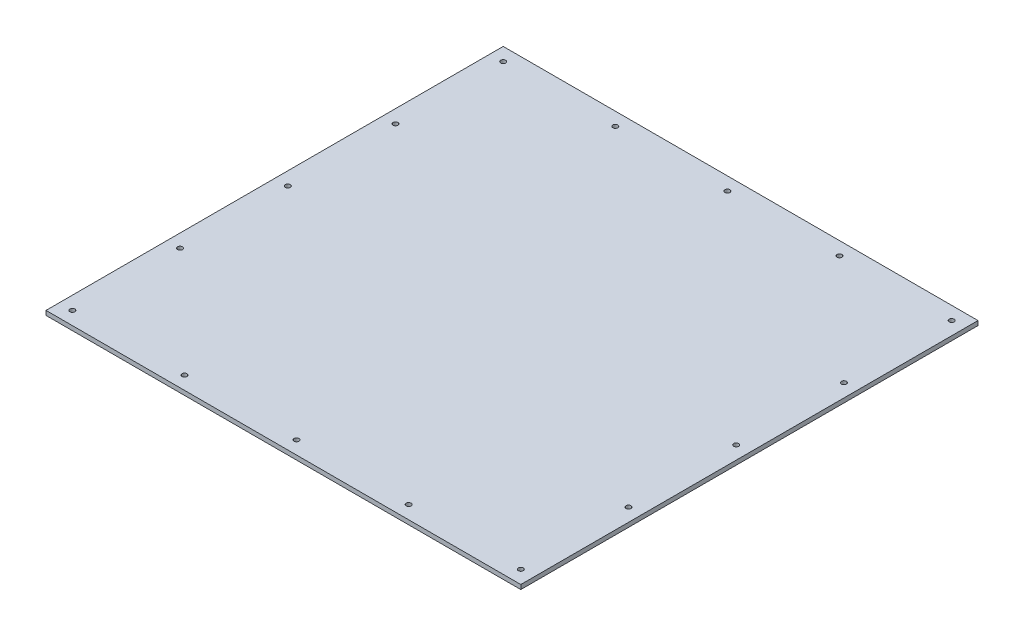
ISO-10303-21;
HEADER;
FILE_DESCRIPTION(('STEP AP214'),'2;1');
FILE_NAME('part.step','',(''),(''),'','','');
FILE_SCHEMA(('AUTOMOTIVE_DESIGN { 1 0 10303 214 1 1 1 1 }'));
ENDSEC;
DATA;
#1=APPLICATION_CONTEXT('core data for automotive mechanical design processes');
#2=APPLICATION_PROTOCOL_DEFINITION('international standard','automotive_design',2000,#1);
#3=PRODUCT_CONTEXT('',#1,'mechanical');
#4=PRODUCT('Part','Part','',(#3));
#5=PRODUCT_RELATED_PRODUCT_CATEGORY('part','',(#4));
#6=PRODUCT_DEFINITION_FORMATION('','',#4);
#7=PRODUCT_DEFINITION_CONTEXT('part definition',#1,'design');
#8=PRODUCT_DEFINITION('design','',#6,#7);
#9=PRODUCT_DEFINITION_SHAPE('','',#8);
#10=(LENGTH_UNIT() NAMED_UNIT(*) SI_UNIT(.MILLI.,.METRE.));
#11=(NAMED_UNIT(*) PLANE_ANGLE_UNIT() SI_UNIT($,.RADIAN.));
#12=(NAMED_UNIT(*) SI_UNIT($,.STERADIAN.) SOLID_ANGLE_UNIT());
#13=UNCERTAINTY_MEASURE_WITH_UNIT(LENGTH_MEASURE(1.E-05),#10,'distance_accuracy_value','');
#14=(GEOMETRIC_REPRESENTATION_CONTEXT(3) GLOBAL_UNCERTAINTY_ASSIGNED_CONTEXT((#13)) GLOBAL_UNIT_ASSIGNED_CONTEXT((#10,
#11,#12)) REPRESENTATION_CONTEXT('',''));
#15=CARTESIAN_POINT('',(0.,0.,0.));
#16=DIRECTION('',(0.,0.,1.));
#17=DIRECTION('',(1.,0.,0.));
#18=AXIS2_PLACEMENT_3D('',#15,#16,#17);
#19=CARTESIAN_POINT('',(0.,6.35,0.));
#20=DIRECTION('',(0.,1.,0.));
#21=DIRECTION('',(0.,0.,1.));
#22=AXIS2_PLACEMENT_3D('',#19,#20,#21);
#23=PLANE('',#22);
#24=CARTESIAN_POINT('',(504.825,6.35,641.35));
#25=DIRECTION('',(0.,1.,0.));
#26=DIRECTION('',(0.,0.,1.));
#27=AXIS2_PLACEMENT_3D('',#24,#25,#26);
#28=CIRCLE('',#27,3.56999999999996);
#29=CARTESIAN_POINT('',(504.825,6.35,644.92));
#30=VERTEX_POINT('',#29);
#31=EDGE_CURVE('E156',#30,#30,#28,.T.);
#32=ORIENTED_EDGE('',*,*,#31,.F.);
#33=EDGE_LOOP('',(#32));
#34=FACE_BOUND('',#33,.T.);
#35=CARTESIAN_POINT('',(19.0500000000001,6.35,485.775));
#36=DIRECTION('',(0.,1.,0.));
#37=DIRECTION('',(0.,0.,1.));
#38=AXIS2_PLACEMENT_3D('',#35,#36,#37);
#39=CIRCLE('',#38,3.57);
#40=CARTESIAN_POINT('',(19.0500000000001,6.35,489.345));
#41=VERTEX_POINT('',#40);
#42=EDGE_CURVE('E173',#41,#41,#39,.T.);
#43=ORIENTED_EDGE('',*,*,#42,.F.);
#44=EDGE_LOOP('',(#43));
#45=FACE_BOUND('',#44,.T.);
#46=CARTESIAN_POINT('',(666.75,6.35,174.625));
#47=DIRECTION('',(0.,1.,0.));
#48=DIRECTION('',(0.,0.,1.));
#49=AXIS2_PLACEMENT_3D('',#46,#47,#48);
#50=CIRCLE('',#49,3.56999999999996);
#51=CARTESIAN_POINT('',(666.75,6.35,178.195));
#52=VERTEX_POINT('',#51);
#53=EDGE_CURVE('E189',#52,#52,#50,.T.);
#54=ORIENTED_EDGE('',*,*,#53,.F.);
#55=EDGE_LOOP('',(#54));
#56=FACE_BOUND('',#55,.T.);
#57=CARTESIAN_POINT('',(180.975,6.35,19.05));
#58=DIRECTION('',(0.,1.,0.));
#59=DIRECTION('',(0.,0.,1.));
#60=AXIS2_PLACEMENT_3D('',#57,#58,#59);
#61=CIRCLE('',#60,3.56999999999998);
#62=CARTESIAN_POINT('',(180.975,6.35,22.62));
#63=VERTEX_POINT('',#62);
#64=EDGE_CURVE('E205',#63,#63,#61,.T.);
#65=ORIENTED_EDGE('',*,*,#64,.F.);
#66=EDGE_LOOP('',(#65));
#67=FACE_BOUND('',#66,.T.);
#68=CARTESIAN_POINT('',(342.9,6.35,641.35));
#69=DIRECTION('',(0.,1.,0.));
#70=DIRECTION('',(0.,0.,1.));
#71=AXIS2_PLACEMENT_3D('',#68,#69,#70);
#72=CIRCLE('',#71,3.57000000000001);
#73=CARTESIAN_POINT('',(342.9,6.35,644.92));
#74=VERTEX_POINT('',#73);
#75=EDGE_CURVE('E221',#74,#74,#72,.T.);
#76=ORIENTED_EDGE('',*,*,#75,.F.);
#77=EDGE_LOOP('',(#76));
#78=FACE_BOUND('',#77,.T.);
#79=CARTESIAN_POINT('',(342.9,6.35,19.05));
#80=DIRECTION('',(0.,1.,0.));
#81=DIRECTION('',(0.,0.,1.));
#82=AXIS2_PLACEMENT_3D('',#79,#80,#81);
#83=CIRCLE('',#82,3.57000000000001);
#84=CARTESIAN_POINT('',(342.9,6.35,22.62));
#85=VERTEX_POINT('',#84);
#86=EDGE_CURVE('E237',#85,#85,#83,.T.);
#87=ORIENTED_EDGE('',*,*,#86,.F.);
#88=EDGE_LOOP('',(#87));
#89=FACE_BOUND('',#88,.T.);
#90=CARTESIAN_POINT('',(666.75,6.35,641.35));
#91=DIRECTION('',(0.,1.,0.));
#92=DIRECTION('',(0.,0.,1.));
#93=AXIS2_PLACEMENT_3D('',#90,#91,#92);
#94=CIRCLE('',#93,3.56999999999996);
#95=CARTESIAN_POINT('',(666.75,6.35,644.92));
#96=VERTEX_POINT('',#95);
#97=EDGE_CURVE('E254',#96,#96,#94,.T.);
#98=ORIENTED_EDGE('',*,*,#97,.F.);
#99=EDGE_LOOP('',(#98));
#100=FACE_BOUND('',#99,.T.);
#101=CARTESIAN_POINT('',(19.05,6.35,19.05));
#102=DIRECTION('',(0.,1.,0.));
#103=DIRECTION('',(0.,0.,1.));
#104=AXIS2_PLACEMENT_3D('',#101,#102,#103);
#105=CIRCLE('',#104,3.57);
#106=CARTESIAN_POINT('',(19.05,6.35,22.62));
#107=VERTEX_POINT('',#106);
#108=EDGE_CURVE('E134',#107,#107,#105,.T.);
#109=ORIENTED_EDGE('',*,*,#108,.F.);
#110=EDGE_LOOP('',(#109));
#111=FACE_BOUND('',#110,.T.);
#112=DIRECTION('',(0.,0.,1.));
#113=VECTOR('',#112,1.);
#114=CARTESIAN_POINT('',(0.,6.35,0.));
#115=LINE('',#114,#113);
#116=CARTESIAN_POINT('',(0.,6.35,0.));
#117=VERTEX_POINT('',#116);
#118=CARTESIAN_POINT('',(0.,6.35,660.4));
#119=VERTEX_POINT('',#118);
#120=EDGE_CURVE('E101',#117,#119,#115,.T.);
#121=ORIENTED_EDGE('',*,*,#120,.T.);
#122=DIRECTION('',(1.,0.,0.));
#123=VECTOR('',#122,1.);
#124=CARTESIAN_POINT('',(0.,6.35,660.4));
#125=LINE('',#124,#123);
#126=CARTESIAN_POINT('',(685.8,6.35,660.4));
#127=VERTEX_POINT('',#126);
#128=EDGE_CURVE('E96',#119,#127,#125,.T.);
#129=ORIENTED_EDGE('',*,*,#128,.T.);
#130=DIRECTION('',(0.,0.,-1.));
#131=VECTOR('',#130,1.);
#132=CARTESIAN_POINT('',(685.8,6.35,0.));
#133=LINE('',#132,#131);
#134=CARTESIAN_POINT('',(685.8,6.35,0.));
#135=VERTEX_POINT('',#134);
#136=EDGE_CURVE('E99',#127,#135,#133,.T.);
#137=ORIENTED_EDGE('',*,*,#136,.T.);
#138=DIRECTION('',(-1.,0.,0.));
#139=VECTOR('',#138,1.);
#140=CARTESIAN_POINT('',(0.,6.35,0.));
#141=LINE('',#140,#139);
#142=EDGE_CURVE('E66',#135,#117,#141,.T.);
#143=ORIENTED_EDGE('',*,*,#142,.T.);
#144=EDGE_LOOP('',(#121,#129,#137,#143));
#145=FACE_BOUND('',#144,.T.);
#146=CARTESIAN_POINT('',(666.75,6.35,19.0499999999999));
#147=DIRECTION('',(0.,1.,0.));
#148=DIRECTION('',(0.,0.,1.));
#149=AXIS2_PLACEMENT_3D('',#146,#147,#148);
#150=CIRCLE('',#149,3.56999999999995);
#151=CARTESIAN_POINT('',(666.75,6.35,22.6199999999999));
#152=VERTEX_POINT('',#151);
#153=EDGE_CURVE('E135',#152,#152,#150,.T.);
#154=ORIENTED_EDGE('',*,*,#153,.F.);
#155=EDGE_LOOP('',(#154));
#156=FACE_BOUND('',#155,.T.);
#157=CARTESIAN_POINT('',(19.0499999999999,6.35,641.35));
#158=DIRECTION('',(0.,1.,0.));
#159=DIRECTION('',(0.,0.,1.));
#160=AXIS2_PLACEMENT_3D('',#157,#158,#159);
#161=CIRCLE('',#160,3.57);
#162=CARTESIAN_POINT('',(19.0499999999999,6.35,644.92));
#163=VERTEX_POINT('',#162);
#164=EDGE_CURVE('E245',#163,#163,#161,.T.);
#165=ORIENTED_EDGE('',*,*,#164,.F.);
#166=EDGE_LOOP('',(#165));
#167=FACE_BOUND('',#166,.T.);
#168=CARTESIAN_POINT('',(19.0499999999999,6.35,330.2));
#169=DIRECTION('',(0.,1.,0.));
#170=DIRECTION('',(0.,0.,1.));
#171=AXIS2_PLACEMENT_3D('',#168,#169,#170);
#172=CIRCLE('',#171,3.57);
#173=CARTESIAN_POINT('',(19.0499999999999,6.35,333.77));
#174=VERTEX_POINT('',#173);
#175=EDGE_CURVE('E229',#174,#174,#172,.T.);
#176=ORIENTED_EDGE('',*,*,#175,.F.);
#177=EDGE_LOOP('',(#176));
#178=FACE_BOUND('',#177,.T.);
#179=CARTESIAN_POINT('',(666.75,6.35,330.2));
#180=DIRECTION('',(0.,1.,0.));
#181=DIRECTION('',(0.,0.,1.));
#182=AXIS2_PLACEMENT_3D('',#179,#180,#181);
#183=CIRCLE('',#182,3.56999999999996);
#184=CARTESIAN_POINT('',(666.75,6.35,333.77));
#185=VERTEX_POINT('',#184);
#186=EDGE_CURVE('E213',#185,#185,#183,.T.);
#187=ORIENTED_EDGE('',*,*,#186,.F.);
#188=EDGE_LOOP('',(#187));
#189=FACE_BOUND('',#188,.T.);
#190=CARTESIAN_POINT('',(504.825,6.35,19.0499999999999));
#191=DIRECTION('',(0.,1.,0.));
#192=DIRECTION('',(0.,0.,1.));
#193=AXIS2_PLACEMENT_3D('',#190,#191,#192);
#194=CIRCLE('',#193,3.56999999999995);
#195=CARTESIAN_POINT('',(504.825,6.35,22.6199999999999));
#196=VERTEX_POINT('',#195);
#197=EDGE_CURVE('E197',#196,#196,#194,.T.);
#198=ORIENTED_EDGE('',*,*,#197,.F.);
#199=EDGE_LOOP('',(#198));
#200=FACE_BOUND('',#199,.T.);
#201=CARTESIAN_POINT('',(19.05,6.35,174.625));
#202=DIRECTION('',(0.,1.,0.));
#203=DIRECTION('',(0.,0.,1.));
#204=AXIS2_PLACEMENT_3D('',#201,#202,#203);
#205=CIRCLE('',#204,3.57);
#206=CARTESIAN_POINT('',(19.05,6.35,178.195));
#207=VERTEX_POINT('',#206);
#208=EDGE_CURVE('E181',#207,#207,#205,.T.);
#209=ORIENTED_EDGE('',*,*,#208,.F.);
#210=EDGE_LOOP('',(#209));
#211=FACE_BOUND('',#210,.T.);
#212=CARTESIAN_POINT('',(666.75,6.35,485.775));
#213=DIRECTION('',(0.,1.,0.));
#214=DIRECTION('',(0.,0.,1.));
#215=AXIS2_PLACEMENT_3D('',#212,#213,#214);
#216=CIRCLE('',#215,3.56999999999996);
#217=CARTESIAN_POINT('',(666.75,6.35,489.345));
#218=VERTEX_POINT('',#217);
#219=EDGE_CURVE('E165',#218,#218,#216,.T.);
#220=ORIENTED_EDGE('',*,*,#219,.F.);
#221=EDGE_LOOP('',(#220));
#222=FACE_BOUND('',#221,.T.);
#223=CARTESIAN_POINT('',(180.975,6.35,641.35));
#224=DIRECTION('',(0.,1.,0.));
#225=DIRECTION('',(0.,0.,1.));
#226=AXIS2_PLACEMENT_3D('',#223,#224,#225);
#227=CIRCLE('',#226,3.56999999999998);
#228=CARTESIAN_POINT('',(180.975,6.35,644.92));
#229=VERTEX_POINT('',#228);
#230=EDGE_CURVE('E155',#229,#229,#227,.T.);
#231=ORIENTED_EDGE('',*,*,#230,.F.);
#232=EDGE_LOOP('',(#231));
#233=FACE_BOUND('',#232,.T.);
#234=ADVANCED_FACE('F48',(#34,#45,#56,#67,#78,#89,#100,#111,#145,#156,#167,#178,#189,#200,#211,
#222,#233),#23,.T.);
#235=CARTESIAN_POINT('',(0.,0.,0.));
#236=DIRECTION('',(0.,1.,0.));
#237=DIRECTION('',(0.,0.,1.));
#238=AXIS2_PLACEMENT_3D('',#235,#236,#237);
#239=PLANE('',#238);
#240=DIRECTION('',(0.,0.,1.));
#241=VECTOR('',#240,1.);
#242=CARTESIAN_POINT('',(0.,0.,0.));
#243=LINE('',#242,#241);
#244=CARTESIAN_POINT('',(0.,0.,0.));
#245=VERTEX_POINT('',#244);
#246=CARTESIAN_POINT('',(0.,0.,660.4));
#247=VERTEX_POINT('',#246);
#248=EDGE_CURVE('E119',#245,#247,#243,.T.);
#249=ORIENTED_EDGE('',*,*,#248,.F.);
#250=DIRECTION('',(-1.,0.,0.));
#251=VECTOR('',#250,1.);
#252=CARTESIAN_POINT('',(0.,0.,0.));
#253=LINE('',#252,#251);
#254=CARTESIAN_POINT('',(685.8,0.,0.));
#255=VERTEX_POINT('',#254);
#256=EDGE_CURVE('E89',#255,#245,#253,.T.);
#257=ORIENTED_EDGE('',*,*,#256,.F.);
#258=DIRECTION('',(0.,0.,-1.));
#259=VECTOR('',#258,1.);
#260=CARTESIAN_POINT('',(685.8,0.,0.));
#261=LINE('',#260,#259);
#262=CARTESIAN_POINT('',(685.8,0.,660.4));
#263=VERTEX_POINT('',#262);
#264=EDGE_CURVE('E83',#263,#255,#261,.T.);
#265=ORIENTED_EDGE('',*,*,#264,.F.);
#266=DIRECTION('',(1.,0.,0.));
#267=VECTOR('',#266,1.);
#268=CARTESIAN_POINT('',(0.,0.,660.4));
#269=LINE('',#268,#267);
#270=EDGE_CURVE('E106',#247,#263,#269,.T.);
#271=ORIENTED_EDGE('',*,*,#270,.F.);
#272=EDGE_LOOP('',(#249,#257,#265,#271));
#273=FACE_BOUND('',#272,.T.);
#274=CARTESIAN_POINT('',(19.05,0.,19.05));
#275=DIRECTION('',(0.,1.,0.));
#276=DIRECTION('',(0.,0.,1.));
#277=AXIS2_PLACEMENT_3D('',#274,#275,#276);
#278=CIRCLE('',#277,3.57);
#279=CARTESIAN_POINT('',(19.05,0.,22.62));
#280=VERTEX_POINT('',#279);
#281=EDGE_CURVE('E130',#280,#280,#278,.T.);
#282=ORIENTED_EDGE('',*,*,#281,.T.);
#283=EDGE_LOOP('',(#282));
#284=FACE_BOUND('',#283,.T.);
#285=CARTESIAN_POINT('',(666.75,0.,19.0499999999999));
#286=DIRECTION('',(0.,1.,0.));
#287=DIRECTION('',(0.,0.,1.));
#288=AXIS2_PLACEMENT_3D('',#285,#286,#287);
#289=CIRCLE('',#288,3.56999999999995);
#290=CARTESIAN_POINT('',(666.75,0.,22.6199999999999));
#291=VERTEX_POINT('',#290);
#292=EDGE_CURVE('E140',#291,#291,#289,.T.);
#293=ORIENTED_EDGE('',*,*,#292,.T.);
#294=EDGE_LOOP('',(#293));
#295=FACE_BOUND('',#294,.T.);
#296=CARTESIAN_POINT('',(666.75,0.,641.35));
#297=DIRECTION('',(0.,1.,0.));
#298=DIRECTION('',(0.,0.,1.));
#299=AXIS2_PLACEMENT_3D('',#296,#297,#298);
#300=CIRCLE('',#299,3.56999999999996);
#301=CARTESIAN_POINT('',(666.75,0.,644.92));
#302=VERTEX_POINT('',#301);
#303=EDGE_CURVE('E250',#302,#302,#300,.T.);
#304=ORIENTED_EDGE('',*,*,#303,.T.);
#305=EDGE_LOOP('',(#304));
#306=FACE_BOUND('',#305,.T.);
#307=CARTESIAN_POINT('',(19.0499999999999,0.,641.35));
#308=DIRECTION('',(0.,1.,0.));
#309=DIRECTION('',(0.,0.,1.));
#310=AXIS2_PLACEMENT_3D('',#307,#308,#309);
#311=CIRCLE('',#310,3.57);
#312=CARTESIAN_POINT('',(19.0499999999999,0.,644.92));
#313=VERTEX_POINT('',#312);
#314=EDGE_CURVE('E241',#313,#313,#311,.T.);
#315=ORIENTED_EDGE('',*,*,#314,.T.);
#316=EDGE_LOOP('',(#315));
#317=FACE_BOUND('',#316,.T.);
#318=CARTESIAN_POINT('',(342.9,0.,19.05));
#319=DIRECTION('',(0.,1.,0.));
#320=DIRECTION('',(0.,0.,1.));
#321=AXIS2_PLACEMENT_3D('',#318,#319,#320);
#322=CIRCLE('',#321,3.57000000000001);
#323=CARTESIAN_POINT('',(342.9,0.,22.62));
#324=VERTEX_POINT('',#323);
#325=EDGE_CURVE('E233',#324,#324,#322,.T.);
#326=ORIENTED_EDGE('',*,*,#325,.T.);
#327=EDGE_LOOP('',(#326));
#328=FACE_BOUND('',#327,.T.);
#329=CARTESIAN_POINT('',(19.0499999999999,0.,330.2));
#330=DIRECTION('',(0.,1.,0.));
#331=DIRECTION('',(0.,0.,1.));
#332=AXIS2_PLACEMENT_3D('',#329,#330,#331);
#333=CIRCLE('',#332,3.57);
#334=CARTESIAN_POINT('',(19.0499999999999,0.,333.77));
#335=VERTEX_POINT('',#334);
#336=EDGE_CURVE('E225',#335,#335,#333,.T.);
#337=ORIENTED_EDGE('',*,*,#336,.T.);
#338=EDGE_LOOP('',(#337));
#339=FACE_BOUND('',#338,.T.);
#340=CARTESIAN_POINT('',(342.9,0.,641.35));
#341=DIRECTION('',(0.,1.,0.));
#342=DIRECTION('',(0.,0.,1.));
#343=AXIS2_PLACEMENT_3D('',#340,#341,#342);
#344=CIRCLE('',#343,3.57000000000001);
#345=CARTESIAN_POINT('',(342.9,0.,644.92));
#346=VERTEX_POINT('',#345);
#347=EDGE_CURVE('E217',#346,#346,#344,.T.);
#348=ORIENTED_EDGE('',*,*,#347,.T.);
#349=EDGE_LOOP('',(#348));
#350=FACE_BOUND('',#349,.T.);
#351=CARTESIAN_POINT('',(666.75,0.,330.2));
#352=DIRECTION('',(0.,1.,0.));
#353=DIRECTION('',(0.,0.,1.));
#354=AXIS2_PLACEMENT_3D('',#351,#352,#353);
#355=CIRCLE('',#354,3.56999999999996);
#356=CARTESIAN_POINT('',(666.75,0.,333.77));
#357=VERTEX_POINT('',#356);
#358=EDGE_CURVE('E209',#357,#357,#355,.T.);
#359=ORIENTED_EDGE('',*,*,#358,.T.);
#360=EDGE_LOOP('',(#359));
#361=FACE_BOUND('',#360,.T.);
#362=CARTESIAN_POINT('',(180.975,0.,19.05));
#363=DIRECTION('',(0.,1.,0.));
#364=DIRECTION('',(0.,0.,1.));
#365=AXIS2_PLACEMENT_3D('',#362,#363,#364);
#366=CIRCLE('',#365,3.56999999999998);
#367=CARTESIAN_POINT('',(180.975,0.,22.62));
#368=VERTEX_POINT('',#367);
#369=EDGE_CURVE('E201',#368,#368,#366,.T.);
#370=ORIENTED_EDGE('',*,*,#369,.T.);
#371=EDGE_LOOP('',(#370));
#372=FACE_BOUND('',#371,.T.);
#373=CARTESIAN_POINT('',(504.825,0.,19.0499999999999));
#374=DIRECTION('',(0.,1.,0.));
#375=DIRECTION('',(0.,0.,1.));
#376=AXIS2_PLACEMENT_3D('',#373,#374,#375);
#377=CIRCLE('',#376,3.56999999999995);
#378=CARTESIAN_POINT('',(504.825,0.,22.6199999999999));
#379=VERTEX_POINT('',#378);
#380=EDGE_CURVE('E193',#379,#379,#377,.T.);
#381=ORIENTED_EDGE('',*,*,#380,.T.);
#382=EDGE_LOOP('',(#381));
#383=FACE_BOUND('',#382,.T.);
#384=CARTESIAN_POINT('',(666.75,0.,174.625));
#385=DIRECTION('',(0.,1.,0.));
#386=DIRECTION('',(0.,0.,1.));
#387=AXIS2_PLACEMENT_3D('',#384,#385,#386);
#388=CIRCLE('',#387,3.56999999999996);
#389=CARTESIAN_POINT('',(666.75,0.,178.195));
#390=VERTEX_POINT('',#389);
#391=EDGE_CURVE('E185',#390,#390,#388,.T.);
#392=ORIENTED_EDGE('',*,*,#391,.T.);
#393=EDGE_LOOP('',(#392));
#394=FACE_BOUND('',#393,.T.);
#395=CARTESIAN_POINT('',(19.05,0.,174.625));
#396=DIRECTION('',(0.,1.,0.));
#397=DIRECTION('',(0.,0.,1.));
#398=AXIS2_PLACEMENT_3D('',#395,#396,#397);
#399=CIRCLE('',#398,3.57);
#400=CARTESIAN_POINT('',(19.05,0.,178.195));
#401=VERTEX_POINT('',#400);
#402=EDGE_CURVE('E177',#401,#401,#399,.T.);
#403=ORIENTED_EDGE('',*,*,#402,.T.);
#404=EDGE_LOOP('',(#403));
#405=FACE_BOUND('',#404,.T.);
#406=CARTESIAN_POINT('',(19.0500000000001,0.,485.775));
#407=DIRECTION('',(0.,1.,0.));
#408=DIRECTION('',(0.,0.,1.));
#409=AXIS2_PLACEMENT_3D('',#406,#407,#408);
#410=CIRCLE('',#409,3.57);
#411=CARTESIAN_POINT('',(19.0500000000001,0.,489.345));
#412=VERTEX_POINT('',#411);
#413=EDGE_CURVE('E169',#412,#412,#410,.T.);
#414=ORIENTED_EDGE('',*,*,#413,.T.);
#415=EDGE_LOOP('',(#414));
#416=FACE_BOUND('',#415,.T.);
#417=CARTESIAN_POINT('',(666.75,0.,485.775));
#418=DIRECTION('',(0.,1.,0.));
#419=DIRECTION('',(0.,0.,1.));
#420=AXIS2_PLACEMENT_3D('',#417,#418,#419);
#421=CIRCLE('',#420,3.56999999999996);
#422=CARTESIAN_POINT('',(666.75,0.,489.345));
#423=VERTEX_POINT('',#422);
#424=EDGE_CURVE('E160',#423,#423,#421,.T.);
#425=ORIENTED_EDGE('',*,*,#424,.T.);
#426=EDGE_LOOP('',(#425));
#427=FACE_BOUND('',#426,.T.);
#428=CARTESIAN_POINT('',(504.825,0.,641.35));
#429=DIRECTION('',(0.,1.,0.));
#430=DIRECTION('',(0.,0.,1.));
#431=AXIS2_PLACEMENT_3D('',#428,#429,#430);
#432=CIRCLE('',#431,3.56999999999996);
#433=CARTESIAN_POINT('',(504.825,0.,644.92));
#434=VERTEX_POINT('',#433);
#435=EDGE_CURVE('E161',#434,#434,#432,.T.);
#436=ORIENTED_EDGE('',*,*,#435,.T.);
#437=EDGE_LOOP('',(#436));
#438=FACE_BOUND('',#437,.T.);
#439=CARTESIAN_POINT('',(180.975,0.,641.35));
#440=DIRECTION('',(0.,1.,0.));
#441=DIRECTION('',(0.,0.,1.));
#442=AXIS2_PLACEMENT_3D('',#439,#440,#441);
#443=CIRCLE('',#442,3.56999999999998);
#444=CARTESIAN_POINT('',(180.975,0.,644.92));
#445=VERTEX_POINT('',#444);
#446=EDGE_CURVE('E149',#445,#445,#443,.T.);
#447=ORIENTED_EDGE('',*,*,#446,.T.);
#448=EDGE_LOOP('',(#447));
#449=FACE_BOUND('',#448,.T.);
#450=ADVANCED_FACE('F270',(#273,#284,#295,#306,#317,#328,#339,#350,#361,#372,#383,#394,#405,
#416,#427,#438,#449),#239,.F.);
#451=CARTESIAN_POINT('',(0.,6.35,0.));
#452=DIRECTION('',(1.,0.,0.));
#453=DIRECTION('',(0.,0.,-1.));
#454=AXIS2_PLACEMENT_3D('',#451,#452,#453);
#455=PLANE('',#454);
#456=ORIENTED_EDGE('',*,*,#248,.T.);
#457=DIRECTION('',(0.,-1.,0.));
#458=VECTOR('',#457,1.);
#459=CARTESIAN_POINT('',(0.,6.35,660.4));
#460=LINE('',#459,#458);
#461=EDGE_CURVE('E12',#119,#247,#460,.T.);
#462=ORIENTED_EDGE('',*,*,#461,.F.);
#463=ORIENTED_EDGE('',*,*,#120,.F.);
#464=DIRECTION('',(0.,-1.,0.));
#465=VECTOR('',#464,1.);
#466=CARTESIAN_POINT('',(0.,6.35,0.));
#467=LINE('',#466,#465);
#468=EDGE_CURVE('E113',#117,#245,#467,.T.);
#469=ORIENTED_EDGE('',*,*,#468,.T.);
#470=EDGE_LOOP('',(#456,#462,#463,#469));
#471=FACE_BOUND('',#470,.T.);
#472=ADVANCED_FACE('F50',(#471),#455,.F.);
#473=CARTESIAN_POINT('',(0.,6.35,660.4));
#474=DIRECTION('',(0.,0.,-1.));
#475=DIRECTION('',(-1.,0.,0.));
#476=AXIS2_PLACEMENT_3D('',#473,#474,#475);
#477=PLANE('',#476);
#478=ORIENTED_EDGE('',*,*,#270,.T.);
#479=DIRECTION('',(0.,-1.,0.));
#480=VECTOR('',#479,1.);
#481=CARTESIAN_POINT('',(685.8,6.35,660.4));
#482=LINE('',#481,#480);
#483=EDGE_CURVE('E58',#127,#263,#482,.T.);
#484=ORIENTED_EDGE('',*,*,#483,.F.);
#485=ORIENTED_EDGE('',*,*,#128,.F.);
#486=ORIENTED_EDGE('',*,*,#461,.T.);
#487=EDGE_LOOP('',(#478,#484,#485,#486));
#488=FACE_BOUND('',#487,.T.);
#489=ADVANCED_FACE('F105',(#488),#477,.F.);
#490=CARTESIAN_POINT('',(685.8,6.35,0.));
#491=DIRECTION('',(-1.,0.,0.));
#492=DIRECTION('',(0.,0.,1.));
#493=AXIS2_PLACEMENT_3D('',#490,#491,#492);
#494=PLANE('',#493);
#495=ORIENTED_EDGE('',*,*,#264,.T.);
#496=DIRECTION('',(0.,-1.,0.));
#497=VECTOR('',#496,1.);
#498=CARTESIAN_POINT('',(685.8,6.35,0.));
#499=LINE('',#498,#497);
#500=EDGE_CURVE('E108',#135,#255,#499,.T.);
#501=ORIENTED_EDGE('',*,*,#500,.F.);
#502=ORIENTED_EDGE('',*,*,#136,.F.);
#503=ORIENTED_EDGE('',*,*,#483,.T.);
#504=EDGE_LOOP('',(#495,#501,#502,#503));
#505=FACE_BOUND('',#504,.T.);
#506=ADVANCED_FACE('F109',(#505),#494,.F.);
#507=CARTESIAN_POINT('',(0.,6.35,0.));
#508=DIRECTION('',(0.,0.,1.));
#509=DIRECTION('',(1.,0.,0.));
#510=AXIS2_PLACEMENT_3D('',#507,#508,#509);
#511=PLANE('',#510);
#512=ORIENTED_EDGE('',*,*,#256,.T.);
#513=ORIENTED_EDGE('',*,*,#468,.F.);
#514=ORIENTED_EDGE('',*,*,#142,.F.);
#515=ORIENTED_EDGE('',*,*,#500,.T.);
#516=EDGE_LOOP('',(#512,#513,#514,#515));
#517=FACE_BOUND('',#516,.T.);
#518=ADVANCED_FACE('F285',(#517),#511,.F.);
#519=CARTESIAN_POINT('',(19.05,6.35,19.05));
#520=DIRECTION('',(0.,-1.,0.));
#521=DIRECTION('',(0.,0.,-1.));
#522=AXIS2_PLACEMENT_3D('',#519,#520,#521);
#523=CYLINDRICAL_SURFACE('',#522,3.57);
#524=ORIENTED_EDGE('',*,*,#108,.T.);
#525=EDGE_LOOP('',(#524));
#526=FACE_BOUND('',#525,.T.);
#527=ORIENTED_EDGE('',*,*,#281,.F.);
#528=EDGE_LOOP('',(#527));
#529=FACE_BOUND('',#528,.T.);
#530=ADVANCED_FACE('F276',(#526,#529),#523,.F.);
#531=CARTESIAN_POINT('',(666.75,6.35,19.0499999999999));
#532=DIRECTION('',(0.,-1.,0.));
#533=DIRECTION('',(0.,0.,-1.));
#534=AXIS2_PLACEMENT_3D('',#531,#532,#533);
#535=CYLINDRICAL_SURFACE('',#534,3.56999999999995);
#536=ORIENTED_EDGE('',*,*,#153,.T.);
#537=EDGE_LOOP('',(#536));
#538=FACE_BOUND('',#537,.T.);
#539=ORIENTED_EDGE('',*,*,#292,.F.);
#540=EDGE_LOOP('',(#539));
#541=FACE_BOUND('',#540,.T.);
#542=ADVANCED_FACE('F273',(#538,#541),#535,.F.);
#543=CARTESIAN_POINT('',(666.75,6.35,641.35));
#544=DIRECTION('',(0.,-1.,0.));
#545=DIRECTION('',(0.,0.,-1.));
#546=AXIS2_PLACEMENT_3D('',#543,#544,#545);
#547=CYLINDRICAL_SURFACE('',#546,3.56999999999996);
#548=ORIENTED_EDGE('',*,*,#97,.T.);
#549=EDGE_LOOP('',(#548));
#550=FACE_BOUND('',#549,.T.);
#551=ORIENTED_EDGE('',*,*,#303,.F.);
#552=EDGE_LOOP('',(#551));
#553=FACE_BOUND('',#552,.T.);
#554=ADVANCED_FACE('F275',(#550,#553),#547,.F.);
#555=CARTESIAN_POINT('',(19.0499999999999,6.35,641.35));
#556=DIRECTION('',(0.,-1.,0.));
#557=DIRECTION('',(0.,0.,-1.));
#558=AXIS2_PLACEMENT_3D('',#555,#556,#557);
#559=CYLINDRICAL_SURFACE('',#558,3.57);
#560=ORIENTED_EDGE('',*,*,#164,.T.);
#561=EDGE_LOOP('',(#560));
#562=FACE_BOUND('',#561,.T.);
#563=ORIENTED_EDGE('',*,*,#314,.F.);
#564=EDGE_LOOP('',(#563));
#565=FACE_BOUND('',#564,.T.);
#566=ADVANCED_FACE('F282',(#562,#565),#559,.F.);
#567=CARTESIAN_POINT('',(342.9,6.35,19.05));
#568=DIRECTION('',(0.,-1.,0.));
#569=DIRECTION('',(0.,0.,-1.));
#570=AXIS2_PLACEMENT_3D('',#567,#568,#569);
#571=CYLINDRICAL_SURFACE('',#570,3.57000000000001);
#572=ORIENTED_EDGE('',*,*,#86,.T.);
#573=EDGE_LOOP('',(#572));
#574=FACE_BOUND('',#573,.T.);
#575=ORIENTED_EDGE('',*,*,#325,.F.);
#576=EDGE_LOOP('',(#575));
#577=FACE_BOUND('',#576,.T.);
#578=ADVANCED_FACE('F384',(#574,#577),#571,.F.);
#579=CARTESIAN_POINT('',(19.0499999999999,6.35,330.2));
#580=DIRECTION('',(0.,-1.,0.));
#581=DIRECTION('',(0.,0.,-1.));
#582=AXIS2_PLACEMENT_3D('',#579,#580,#581);
#583=CYLINDRICAL_SURFACE('',#582,3.57);
#584=ORIENTED_EDGE('',*,*,#175,.T.);
#585=EDGE_LOOP('',(#584));
#586=FACE_BOUND('',#585,.T.);
#587=ORIENTED_EDGE('',*,*,#336,.F.);
#588=EDGE_LOOP('',(#587));
#589=FACE_BOUND('',#588,.T.);
#590=ADVANCED_FACE('F395',(#586,#589),#583,.F.);
#591=CARTESIAN_POINT('',(342.9,6.35,641.35));
#592=DIRECTION('',(0.,-1.,0.));
#593=DIRECTION('',(0.,0.,-1.));
#594=AXIS2_PLACEMENT_3D('',#591,#592,#593);
#595=CYLINDRICAL_SURFACE('',#594,3.57000000000001);
#596=ORIENTED_EDGE('',*,*,#75,.T.);
#597=EDGE_LOOP('',(#596));
#598=FACE_BOUND('',#597,.T.);
#599=ORIENTED_EDGE('',*,*,#347,.F.);
#600=EDGE_LOOP('',(#599));
#601=FACE_BOUND('',#600,.T.);
#602=ADVANCED_FACE('F406',(#598,#601),#595,.F.);
#603=CARTESIAN_POINT('',(666.75,6.35,330.2));
#604=DIRECTION('',(0.,-1.,0.));
#605=DIRECTION('',(0.,0.,-1.));
#606=AXIS2_PLACEMENT_3D('',#603,#604,#605);
#607=CYLINDRICAL_SURFACE('',#606,3.56999999999996);
#608=ORIENTED_EDGE('',*,*,#186,.T.);
#609=EDGE_LOOP('',(#608));
#610=FACE_BOUND('',#609,.T.);
#611=ORIENTED_EDGE('',*,*,#358,.F.);
#612=EDGE_LOOP('',(#611));
#613=FACE_BOUND('',#612,.T.);
#614=ADVANCED_FACE('F417',(#610,#613),#607,.F.);
#615=CARTESIAN_POINT('',(180.975,6.35,19.05));
#616=DIRECTION('',(0.,-1.,0.));
#617=DIRECTION('',(0.,0.,-1.));
#618=AXIS2_PLACEMENT_3D('',#615,#616,#617);
#619=CYLINDRICAL_SURFACE('',#618,3.56999999999998);
#620=ORIENTED_EDGE('',*,*,#64,.T.);
#621=EDGE_LOOP('',(#620));
#622=FACE_BOUND('',#621,.T.);
#623=ORIENTED_EDGE('',*,*,#369,.F.);
#624=EDGE_LOOP('',(#623));
#625=FACE_BOUND('',#624,.T.);
#626=ADVANCED_FACE('F428',(#622,#625),#619,.F.);
#627=CARTESIAN_POINT('',(504.825,6.35,19.0499999999999));
#628=DIRECTION('',(0.,-1.,0.));
#629=DIRECTION('',(0.,0.,-1.));
#630=AXIS2_PLACEMENT_3D('',#627,#628,#629);
#631=CYLINDRICAL_SURFACE('',#630,3.56999999999995);
#632=ORIENTED_EDGE('',*,*,#197,.T.);
#633=EDGE_LOOP('',(#632));
#634=FACE_BOUND('',#633,.T.);
#635=ORIENTED_EDGE('',*,*,#380,.F.);
#636=EDGE_LOOP('',(#635));
#637=FACE_BOUND('',#636,.T.);
#638=ADVANCED_FACE('F439',(#634,#637),#631,.F.);
#639=CARTESIAN_POINT('',(666.75,6.35,174.625));
#640=DIRECTION('',(0.,-1.,0.));
#641=DIRECTION('',(0.,0.,-1.));
#642=AXIS2_PLACEMENT_3D('',#639,#640,#641);
#643=CYLINDRICAL_SURFACE('',#642,3.56999999999996);
#644=ORIENTED_EDGE('',*,*,#53,.T.);
#645=EDGE_LOOP('',(#644));
#646=FACE_BOUND('',#645,.T.);
#647=ORIENTED_EDGE('',*,*,#391,.F.);
#648=EDGE_LOOP('',(#647));
#649=FACE_BOUND('',#648,.T.);
#650=ADVANCED_FACE('F450',(#646,#649),#643,.F.);
#651=CARTESIAN_POINT('',(19.05,6.35,174.625));
#652=DIRECTION('',(0.,-1.,0.));
#653=DIRECTION('',(0.,0.,-1.));
#654=AXIS2_PLACEMENT_3D('',#651,#652,#653);
#655=CYLINDRICAL_SURFACE('',#654,3.57);
#656=ORIENTED_EDGE('',*,*,#208,.T.);
#657=EDGE_LOOP('',(#656));
#658=FACE_BOUND('',#657,.T.);
#659=ORIENTED_EDGE('',*,*,#402,.F.);
#660=EDGE_LOOP('',(#659));
#661=FACE_BOUND('',#660,.T.);
#662=ADVANCED_FACE('F461',(#658,#661),#655,.F.);
#663=CARTESIAN_POINT('',(19.0500000000001,6.35,485.775));
#664=DIRECTION('',(0.,-1.,0.));
#665=DIRECTION('',(0.,0.,-1.));
#666=AXIS2_PLACEMENT_3D('',#663,#664,#665);
#667=CYLINDRICAL_SURFACE('',#666,3.57);
#668=ORIENTED_EDGE('',*,*,#42,.T.);
#669=EDGE_LOOP('',(#668));
#670=FACE_BOUND('',#669,.T.);
#671=ORIENTED_EDGE('',*,*,#413,.F.);
#672=EDGE_LOOP('',(#671));
#673=FACE_BOUND('',#672,.T.);
#674=ADVANCED_FACE('F472',(#670,#673),#667,.F.);
#675=CARTESIAN_POINT('',(666.75,6.35,485.775));
#676=DIRECTION('',(0.,-1.,0.));
#677=DIRECTION('',(0.,0.,-1.));
#678=AXIS2_PLACEMENT_3D('',#675,#676,#677);
#679=CYLINDRICAL_SURFACE('',#678,3.56999999999996);
#680=ORIENTED_EDGE('',*,*,#219,.T.);
#681=EDGE_LOOP('',(#680));
#682=FACE_BOUND('',#681,.T.);
#683=ORIENTED_EDGE('',*,*,#424,.F.);
#684=EDGE_LOOP('',(#683));
#685=FACE_BOUND('',#684,.T.);
#686=ADVANCED_FACE('F483',(#682,#685),#679,.F.);
#687=CARTESIAN_POINT('',(504.825,6.35,641.35));
#688=DIRECTION('',(0.,-1.,0.));
#689=DIRECTION('',(0.,0.,-1.));
#690=AXIS2_PLACEMENT_3D('',#687,#688,#689);
#691=CYLINDRICAL_SURFACE('',#690,3.56999999999996);
#692=ORIENTED_EDGE('',*,*,#31,.T.);
#693=EDGE_LOOP('',(#692));
#694=FACE_BOUND('',#693,.T.);
#695=ORIENTED_EDGE('',*,*,#435,.F.);
#696=EDGE_LOOP('',(#695));
#697=FACE_BOUND('',#696,.T.);
#698=ADVANCED_FACE('F494',(#694,#697),#691,.F.);
#699=CARTESIAN_POINT('',(180.975,6.35,641.35));
#700=DIRECTION('',(0.,-1.,0.));
#701=DIRECTION('',(0.,0.,-1.));
#702=AXIS2_PLACEMENT_3D('',#699,#700,#701);
#703=CYLINDRICAL_SURFACE('',#702,3.56999999999998);
#704=ORIENTED_EDGE('',*,*,#230,.T.);
#705=EDGE_LOOP('',(#704));
#706=FACE_BOUND('',#705,.T.);
#707=ORIENTED_EDGE('',*,*,#446,.F.);
#708=EDGE_LOOP('',(#707));
#709=FACE_BOUND('',#708,.T.);
#710=ADVANCED_FACE('F505',(#706,#709),#703,.F.);
#711=CLOSED_SHELL('',(#234,#450,#472,#489,#506,#518,#530,#542,#554,#566,#578,#590,#602,#614,
#626,#638,#650,#662,#674,#686,#698,#710));
#712=MANIFOLD_SOLID_BREP('B2',#711);
#713=ADVANCED_BREP_SHAPE_REPRESENTATION('',(#18,#712),#14);
#714=SHAPE_DEFINITION_REPRESENTATION(#9,#713);
ENDSEC;
END-ISO-10303-21;
